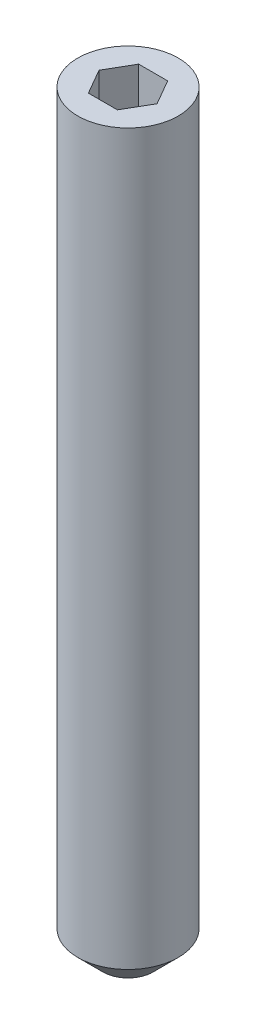
ISO-10303-21;
HEADER;
FILE_DESCRIPTION(('STEP AP214'),'2;1');
FILE_NAME('part.step','',(''),(''),'','','');
FILE_SCHEMA(('AUTOMOTIVE_DESIGN { 1 0 10303 214 1 1 1 1 }'));
ENDSEC;
DATA;
#1=APPLICATION_CONTEXT('core data for automotive mechanical design processes');
#2=APPLICATION_PROTOCOL_DEFINITION('international standard','automotive_design',2000,#1);
#3=PRODUCT_CONTEXT('',#1,'mechanical');
#4=PRODUCT('Part','Part','',(#3));
#5=PRODUCT_RELATED_PRODUCT_CATEGORY('part','',(#4));
#6=PRODUCT_DEFINITION_FORMATION('','',#4);
#7=PRODUCT_DEFINITION_CONTEXT('part definition',#1,'design');
#8=PRODUCT_DEFINITION('design','',#6,#7);
#9=PRODUCT_DEFINITION_SHAPE('','',#8);
#10=(LENGTH_UNIT() NAMED_UNIT(*) SI_UNIT(.MILLI.,.METRE.));
#11=(NAMED_UNIT(*) PLANE_ANGLE_UNIT() SI_UNIT($,.RADIAN.));
#12=(NAMED_UNIT(*) SI_UNIT($,.STERADIAN.) SOLID_ANGLE_UNIT());
#13=UNCERTAINTY_MEASURE_WITH_UNIT(LENGTH_MEASURE(1.E-05),#10,'distance_accuracy_value','');
#14=(GEOMETRIC_REPRESENTATION_CONTEXT(3) GLOBAL_UNCERTAINTY_ASSIGNED_CONTEXT((#13)) GLOBAL_UNIT_ASSIGNED_CONTEXT((#10,
#11,#12)) REPRESENTATION_CONTEXT('',''));
#15=CARTESIAN_POINT('',(0.,0.,0.));
#16=DIRECTION('',(0.,0.,1.));
#17=DIRECTION('',(1.,0.,0.));
#18=AXIS2_PLACEMENT_3D('',#15,#16,#17);
#19=CARTESIAN_POINT('',(0.577350269189626,26.,1.));
#20=DIRECTION('',(0.866025403784438,0.,0.5));
#21=DIRECTION('',(0.5,0.,-0.866025403784438));
#22=AXIS2_PLACEMENT_3D('',#19,#20,#21);
#23=PLANE('',#22);
#24=DIRECTION('',(0.5,0.,-0.866025403784438));
#25=VECTOR('',#24,1.);
#26=CARTESIAN_POINT('',(0.577350269189626,26.,1.));
#27=LINE('',#26,#25);
#28=CARTESIAN_POINT('',(0.577350269189626,26.,1.));
#29=VERTEX_POINT('',#28);
#30=CARTESIAN_POINT('',(1.15470053837925,26.,0.));
#31=VERTEX_POINT('',#30);
#32=EDGE_CURVE('E66',#29,#31,#27,.T.);
#33=ORIENTED_EDGE('',*,*,#32,.F.);
#34=DIRECTION('',(0.,1.,0.));
#35=VECTOR('',#34,1.);
#36=CARTESIAN_POINT('',(0.577350269189626,26.,1.));
#37=LINE('',#36,#35);
#38=CARTESIAN_POINT('',(0.577350269189626,30.,1.));
#39=VERTEX_POINT('',#38);
#40=EDGE_CURVE('E86',#29,#39,#37,.T.);
#41=ORIENTED_EDGE('',*,*,#40,.T.);
#42=DIRECTION('',(0.5,0.,-0.866025403784438));
#43=VECTOR('',#42,1.);
#44=CARTESIAN_POINT('',(0.577350269189626,30.,1.));
#45=LINE('',#44,#43);
#46=CARTESIAN_POINT('',(1.15470053837925,30.,0.));
#47=VERTEX_POINT('',#46);
#48=EDGE_CURVE('E74',#47,#39,#45,.F.);
#49=ORIENTED_EDGE('',*,*,#48,.F.);
#50=DIRECTION('',(0.,1.,0.));
#51=VECTOR('',#50,1.);
#52=CARTESIAN_POINT('',(1.15470053837925,26.,0.));
#53=LINE('',#52,#51);
#54=EDGE_CURVE('E81',#47,#31,#53,.F.);
#55=ORIENTED_EDGE('',*,*,#54,.T.);
#56=EDGE_LOOP('',(#33,#41,#49,#55));
#57=FACE_BOUND('',#56,.T.);
#58=ADVANCED_FACE('F17',(#57),#23,.F.);
#59=CARTESIAN_POINT('',(1.15470053837925,26.,0.));
#60=DIRECTION('',(0.866025403784438,0.,-0.5));
#61=DIRECTION('',(-0.5,0.,-0.866025403784438));
#62=AXIS2_PLACEMENT_3D('',#59,#60,#61);
#63=PLANE('',#62);
#64=DIRECTION('',(-0.5,0.,-0.866025403784438));
#65=VECTOR('',#64,1.);
#66=CARTESIAN_POINT('',(1.15470053837925,26.,0.));
#67=LINE('',#66,#65);
#68=CARTESIAN_POINT('',(0.577350269189626,26.,-1.));
#69=VERTEX_POINT('',#68);
#70=EDGE_CURVE('E90',#31,#69,#67,.T.);
#71=ORIENTED_EDGE('',*,*,#70,.F.);
#72=ORIENTED_EDGE('',*,*,#54,.F.);
#73=DIRECTION('',(-0.5,0.,-0.866025403784438));
#74=VECTOR('',#73,1.);
#75=CARTESIAN_POINT('',(1.15470053837925,30.,0.));
#76=LINE('',#75,#74);
#77=CARTESIAN_POINT('',(0.577350269189625,30.,-1.));
#78=VERTEX_POINT('',#77);
#79=EDGE_CURVE('E70',#78,#47,#76,.F.);
#80=ORIENTED_EDGE('',*,*,#79,.F.);
#81=DIRECTION('',(0.,1.,0.));
#82=VECTOR('',#81,1.);
#83=CARTESIAN_POINT('',(0.577350269189625,26.,-1.));
#84=LINE('',#83,#82);
#85=EDGE_CURVE('E124',#78,#69,#84,.F.);
#86=ORIENTED_EDGE('',*,*,#85,.T.);
#87=EDGE_LOOP('',(#71,#72,#80,#86));
#88=FACE_BOUND('',#87,.T.);
#89=ADVANCED_FACE('F89',(#88),#63,.F.);
#90=CARTESIAN_POINT('',(-0.577350269189626,26.,1.));
#91=DIRECTION('',(0.,0.,1.));
#92=DIRECTION('',(1.,0.,0.));
#93=AXIS2_PLACEMENT_3D('',#90,#91,#92);
#94=PLANE('',#93);
#95=DIRECTION('',(1.,0.,0.));
#96=VECTOR('',#95,1.);
#97=CARTESIAN_POINT('',(1.15470053837925,26.,1.));
#98=LINE('',#97,#96);
#99=CARTESIAN_POINT('',(-0.577350269189626,26.,1.));
#100=VERTEX_POINT('',#99);
#101=EDGE_CURVE('E122',#100,#29,#98,.T.);
#102=ORIENTED_EDGE('',*,*,#101,.F.);
#103=DIRECTION('',(0.,1.,0.));
#104=VECTOR('',#103,1.);
#105=CARTESIAN_POINT('',(-0.577350269189626,26.,1.));
#106=LINE('',#105,#104);
#107=CARTESIAN_POINT('',(-0.577350269189626,30.,1.));
#108=VERTEX_POINT('',#107);
#109=EDGE_CURVE('E112',#100,#108,#106,.T.);
#110=ORIENTED_EDGE('',*,*,#109,.T.);
#111=DIRECTION('',(1.,0.,0.));
#112=VECTOR('',#111,1.);
#113=CARTESIAN_POINT('',(-0.577350269189626,30.,1.));
#114=LINE('',#113,#112);
#115=EDGE_CURVE('E92',#39,#108,#114,.F.);
#116=ORIENTED_EDGE('',*,*,#115,.F.);
#117=ORIENTED_EDGE('',*,*,#40,.F.);
#118=EDGE_LOOP('',(#102,#110,#116,#117));
#119=FACE_BOUND('',#118,.T.);
#120=ADVANCED_FACE('F129',(#119),#94,.F.);
#121=CARTESIAN_POINT('',(0.577350269189625,26.,-1.));
#122=DIRECTION('',(0.,0.,-1.));
#123=DIRECTION('',(-1.,0.,0.));
#124=AXIS2_PLACEMENT_3D('',#121,#122,#123);
#125=PLANE('',#124);
#126=DIRECTION('',(1.,0.,0.));
#127=VECTOR('',#126,1.);
#128=CARTESIAN_POINT('',(1.15470053837925,26.,-1.));
#129=LINE('',#128,#127);
#130=CARTESIAN_POINT('',(-0.577350269189626,26.,-1.));
#131=VERTEX_POINT('',#130);
#132=EDGE_CURVE('E119',#69,#131,#129,.F.);
#133=ORIENTED_EDGE('',*,*,#132,.F.);
#134=ORIENTED_EDGE('',*,*,#85,.F.);
#135=DIRECTION('',(-1.,0.,0.));
#136=VECTOR('',#135,1.);
#137=CARTESIAN_POINT('',(0.577350269189625,30.,-1.));
#138=LINE('',#137,#136);
#139=CARTESIAN_POINT('',(-0.577350269189626,30.,-1.));
#140=VERTEX_POINT('',#139);
#141=EDGE_CURVE('E76',#140,#78,#138,.F.);
#142=ORIENTED_EDGE('',*,*,#141,.F.);
#143=DIRECTION('',(0.,1.,0.));
#144=VECTOR('',#143,1.);
#145=CARTESIAN_POINT('',(-0.577350269189626,26.,-1.));
#146=LINE('',#145,#144);
#147=EDGE_CURVE('E110',#140,#131,#146,.F.);
#148=ORIENTED_EDGE('',*,*,#147,.T.);
#149=EDGE_LOOP('',(#133,#134,#142,#148));
#150=FACE_BOUND('',#149,.T.);
#151=ADVANCED_FACE('F140',(#150),#125,.F.);
#152=CARTESIAN_POINT('',(1.15470053837925,26.,0.));
#153=DIRECTION('',(0.,1.,0.));
#154=DIRECTION('',(0.,0.,1.));
#155=AXIS2_PLACEMENT_3D('',#152,#153,#154);
#156=PLANE('',#155);
#157=ORIENTED_EDGE('',*,*,#132,.T.);
#158=DIRECTION('',(-0.5,0.,0.866025403784439));
#159=VECTOR('',#158,1.);
#160=CARTESIAN_POINT('',(-0.577350269189626,26.,-1.));
#161=LINE('',#160,#159);
#162=CARTESIAN_POINT('',(-1.15470053837925,26.,0.));
#163=VERTEX_POINT('',#162);
#164=EDGE_CURVE('E106',#131,#163,#161,.T.);
#165=ORIENTED_EDGE('',*,*,#164,.T.);
#166=DIRECTION('',(0.5,0.,0.866025403784439));
#167=VECTOR('',#166,1.);
#168=CARTESIAN_POINT('',(-1.15470053837925,26.,0.));
#169=LINE('',#168,#167);
#170=EDGE_CURVE('E115',#163,#100,#169,.T.);
#171=ORIENTED_EDGE('',*,*,#170,.T.);
#172=ORIENTED_EDGE('',*,*,#101,.T.);
#173=ORIENTED_EDGE('',*,*,#32,.T.);
#174=ORIENTED_EDGE('',*,*,#70,.T.);
#175=EDGE_LOOP('',(#157,#165,#171,#172,#173,#174));
#176=FACE_BOUND('',#175,.T.);
#177=ADVANCED_FACE('F141',(#176),#156,.T.);
#178=CARTESIAN_POINT('',(-1.15470053837925,26.,0.));
#179=DIRECTION('',(-0.866025403784439,0.,0.5));
#180=DIRECTION('',(0.5,0.,0.866025403784439));
#181=AXIS2_PLACEMENT_3D('',#178,#179,#180);
#182=PLANE('',#181);
#183=ORIENTED_EDGE('',*,*,#170,.F.);
#184=DIRECTION('',(0.,1.,0.));
#185=VECTOR('',#184,1.);
#186=CARTESIAN_POINT('',(-1.15470053837925,26.,0.));
#187=LINE('',#186,#185);
#188=CARTESIAN_POINT('',(-1.15470053837925,30.,0.));
#189=VERTEX_POINT('',#188);
#190=EDGE_CURVE('E103',#163,#189,#187,.T.);
#191=ORIENTED_EDGE('',*,*,#190,.T.);
#192=DIRECTION('',(0.5,0.,0.866025403784439));
#193=VECTOR('',#192,1.);
#194=CARTESIAN_POINT('',(-1.15470053837925,30.,0.));
#195=LINE('',#194,#193);
#196=EDGE_CURVE('E35',#108,#189,#195,.F.);
#197=ORIENTED_EDGE('',*,*,#196,.F.);
#198=ORIENTED_EDGE('',*,*,#109,.F.);
#199=EDGE_LOOP('',(#183,#191,#197,#198));
#200=FACE_BOUND('',#199,.T.);
#201=ADVANCED_FACE('F132',(#200),#182,.F.);
#202=CARTESIAN_POINT('',(-0.577350269189626,26.,-1.));
#203=DIRECTION('',(-0.866025403784439,0.,-0.5));
#204=DIRECTION('',(-0.5,0.,0.866025403784439));
#205=AXIS2_PLACEMENT_3D('',#202,#203,#204);
#206=PLANE('',#205);
#207=ORIENTED_EDGE('',*,*,#164,.F.);
#208=ORIENTED_EDGE('',*,*,#147,.F.);
#209=DIRECTION('',(0.5,0.,-0.866025403784439));
#210=VECTOR('',#209,1.);
#211=CARTESIAN_POINT('',(-1.15470053837925,30.,0.));
#212=LINE('',#211,#210);
#213=EDGE_CURVE('E100',#189,#140,#212,.T.);
#214=ORIENTED_EDGE('',*,*,#213,.F.);
#215=ORIENTED_EDGE('',*,*,#190,.F.);
#216=EDGE_LOOP('',(#207,#208,#214,#215));
#217=FACE_BOUND('',#216,.T.);
#218=ADVANCED_FACE('F137',(#217),#206,.F.);
#219=CARTESIAN_POINT('',(0.,0.,0.));
#220=DIRECTION('',(0.,-1.,0.));
#221=DIRECTION('',(0.,0.,-1.));
#222=AXIS2_PLACEMENT_3D('',#219,#220,#221);
#223=PLANE('',#222);
#224=CARTESIAN_POINT('',(0.,5.6843418860808E-11,0.));
#225=DIRECTION('',(0.,1.,0.));
#226=DIRECTION('',(0.,0.,1.));
#227=AXIS2_PLACEMENT_3D('',#224,#225,#226);
#228=CIRCLE('',#227,0.999999999862667);
#229=CARTESIAN_POINT('',(0.,5.6843418860808E-11,0.999999999862667));
#230=VERTEX_POINT('',#229);
#231=EDGE_CURVE('E20',#230,#230,#228,.T.);
#232=ORIENTED_EDGE('',*,*,#231,.F.);
#233=EDGE_LOOP('',(#232));
#234=FACE_BOUND('',#233,.T.);
#235=ADVANCED_FACE('F164',(#234),#223,.T.);
#236=CARTESIAN_POINT('',(0.,30.,-2.));
#237=DIRECTION('',(0.,1.,0.));
#238=DIRECTION('',(0.,0.,1.));
#239=AXIS2_PLACEMENT_3D('',#236,#237,#238);
#240=PLANE('',#239);
#241=ORIENTED_EDGE('',*,*,#196,.T.);
#242=ORIENTED_EDGE('',*,*,#213,.T.);
#243=ORIENTED_EDGE('',*,*,#141,.T.);
#244=ORIENTED_EDGE('',*,*,#79,.T.);
#245=ORIENTED_EDGE('',*,*,#48,.T.);
#246=ORIENTED_EDGE('',*,*,#115,.T.);
#247=EDGE_LOOP('',(#241,#242,#243,#244,#245,#246));
#248=FACE_BOUND('',#247,.T.);
#249=CARTESIAN_POINT('',(0.,30.,0.));
#250=DIRECTION('',(0.,-1.,0.));
#251=DIRECTION('',(0.,0.,-1.));
#252=AXIS2_PLACEMENT_3D('',#249,#250,#251);
#253=CIRCLE('',#252,2.);
#254=CARTESIAN_POINT('',(0.,30.,-2.));
#255=VERTEX_POINT('',#254);
#256=EDGE_CURVE('E26',#255,#255,#253,.T.);
#257=ORIENTED_EDGE('',*,*,#256,.F.);
#258=EDGE_LOOP('',(#257));
#259=FACE_BOUND('',#258,.T.);
#260=ADVANCED_FACE('F72',(#248,#259),#240,.T.);
#261=CARTESIAN_POINT('',(0.,1.0000000000332,0.));
#262=DIRECTION('',(0.,1.,0.));
#263=DIRECTION('',(0.,0.,1.));
#264=AXIS2_PLACEMENT_3D('',#261,#262,#263);
#265=CONICAL_SURFACE('',#264,1.99999999989586,0.78539816342587);
#266=CARTESIAN_POINT('',(0.,1.,0.));
#267=DIRECTION('',(0.,-1.,0.));
#268=DIRECTION('',(0.,0.,-1.));
#269=AXIS2_PLACEMENT_3D('',#266,#267,#268);
#270=CIRCLE('',#269,2.);
#271=CARTESIAN_POINT('',(0.,1.,-2.));
#272=VERTEX_POINT('',#271);
#273=EDGE_CURVE('E11',#272,#272,#270,.F.);
#274=ORIENTED_EDGE('',*,*,#273,.F.);
#275=EDGE_LOOP('',(#274));
#276=FACE_BOUND('',#275,.T.);
#277=ORIENTED_EDGE('',*,*,#231,.T.);
#278=EDGE_LOOP('',(#277));
#279=FACE_BOUND('',#278,.T.);
#280=ADVANCED_FACE('F153',(#276,#279),#265,.T.);
#281=CARTESIAN_POINT('',(0.,0.,0.));
#282=DIRECTION('',(0.,-1.,0.));
#283=DIRECTION('',(0.,0.,-1.));
#284=AXIS2_PLACEMENT_3D('',#281,#282,#283);
#285=CYLINDRICAL_SURFACE('',#284,2.);
#286=ORIENTED_EDGE('',*,*,#273,.T.);
#287=EDGE_LOOP('',(#286));
#288=FACE_BOUND('',#287,.T.);
#289=ORIENTED_EDGE('',*,*,#256,.T.);
#290=EDGE_LOOP('',(#289));
#291=FACE_BOUND('',#290,.T.);
#292=ADVANCED_FACE('F151',(#288,#291),#285,.T.);
#293=CLOSED_SHELL('',(#58,#89,#120,#151,#177,#201,#218,#235,#260,#280,#292));
#294=MANIFOLD_SOLID_BREP('B1',#293);
#295=ADVANCED_BREP_SHAPE_REPRESENTATION('',(#18,#294),#14);
#296=SHAPE_DEFINITION_REPRESENTATION(#9,#295);
ENDSEC;
END-ISO-10303-21;
